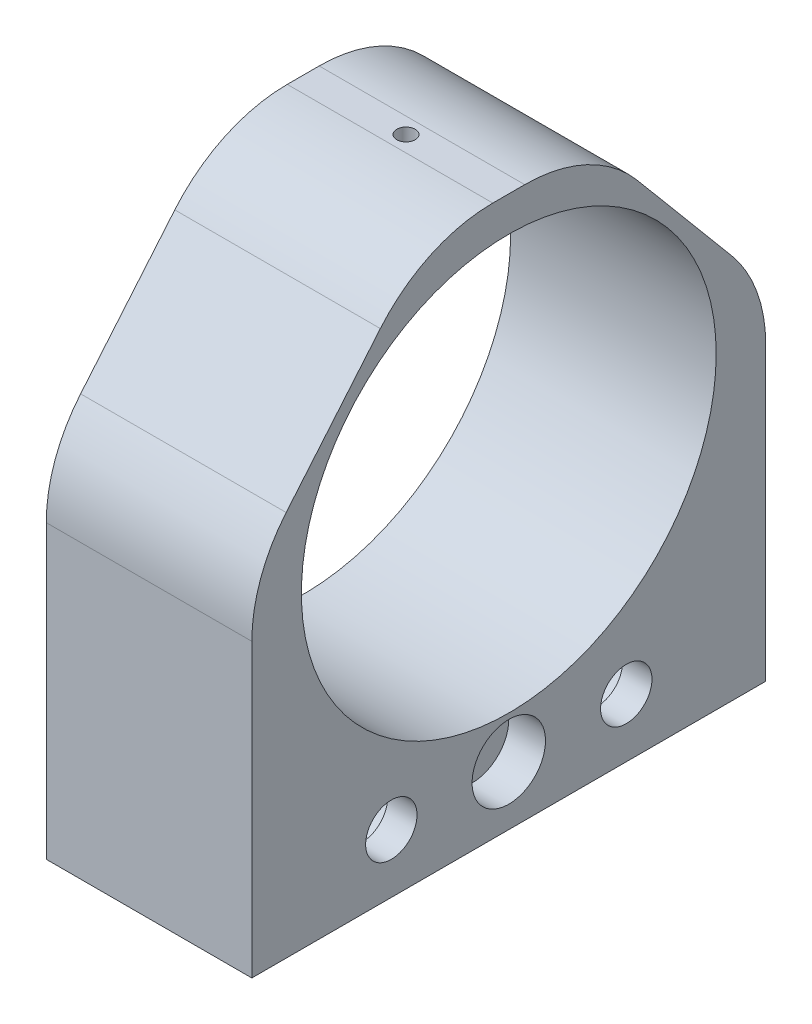
ISO-10303-21;
HEADER;
FILE_DESCRIPTION(('STEP AP214'),'2;1');
FILE_NAME('part.step','',(''),(''),'','','');
FILE_SCHEMA(('AUTOMOTIVE_DESIGN { 1 0 10303 214 1 1 1 1 }'));
ENDSEC;
DATA;
#1=APPLICATION_CONTEXT('core data for automotive mechanical design processes');
#2=APPLICATION_PROTOCOL_DEFINITION('international standard','automotive_design',2000,#1);
#3=PRODUCT_CONTEXT('',#1,'mechanical');
#4=PRODUCT('Part','Part','',(#3));
#5=PRODUCT_RELATED_PRODUCT_CATEGORY('part','',(#4));
#6=PRODUCT_DEFINITION_FORMATION('','',#4);
#7=PRODUCT_DEFINITION_CONTEXT('part definition',#1,'design');
#8=PRODUCT_DEFINITION('design','',#6,#7);
#9=PRODUCT_DEFINITION_SHAPE('','',#8);
#10=(LENGTH_UNIT() NAMED_UNIT(*) SI_UNIT(.MILLI.,.METRE.));
#11=(NAMED_UNIT(*) PLANE_ANGLE_UNIT() SI_UNIT($,.RADIAN.));
#12=(NAMED_UNIT(*) SI_UNIT($,.STERADIAN.) SOLID_ANGLE_UNIT());
#13=UNCERTAINTY_MEASURE_WITH_UNIT(LENGTH_MEASURE(1.E-05),#10,'distance_accuracy_value','');
#14=(GEOMETRIC_REPRESENTATION_CONTEXT(3) GLOBAL_UNCERTAINTY_ASSIGNED_CONTEXT((#13)) GLOBAL_UNIT_ASSIGNED_CONTEXT((#10,
#11,#12)) REPRESENTATION_CONTEXT('',''));
#15=CARTESIAN_POINT('',(0.,0.,0.));
#16=DIRECTION('',(0.,0.,1.));
#17=DIRECTION('',(1.,0.,0.));
#18=AXIS2_PLACEMENT_3D('',#15,#16,#17);
#19=CARTESIAN_POINT('',(0.,-29.5,-16.));
#20=DIRECTION('',(1.,0.,0.));
#21=DIRECTION('',(0.,0.,-1.));
#22=AXIS2_PLACEMENT_3D('',#19,#20,#21);
#23=CYLINDRICAL_SURFACE('',#22,3.5);
#24=CARTESIAN_POINT('',(28.,-29.5,-16.));
#25=DIRECTION('',(1.,0.,0.));
#26=DIRECTION('',(0.,0.,-1.));
#27=AXIS2_PLACEMENT_3D('',#24,#25,#26);
#28=CIRCLE('',#27,3.5);
#29=CARTESIAN_POINT('',(28.,-29.5,-19.5));
#30=VERTEX_POINT('',#29);
#31=EDGE_CURVE('E368',#30,#30,#28,.T.);
#32=ORIENTED_EDGE('',*,*,#31,.T.);
#33=EDGE_LOOP('',(#32));
#34=FACE_BOUND('',#33,.T.);
#35=CARTESIAN_POINT('',(24.,-29.5,-16.));
#36=DIRECTION('',(-1.,0.,0.));
#37=DIRECTION('',(0.,0.,1.));
#38=AXIS2_PLACEMENT_3D('',#35,#36,#37);
#39=CIRCLE('',#38,3.5);
#40=CARTESIAN_POINT('',(24.,-29.5,-12.5));
#41=VERTEX_POINT('',#40);
#42=EDGE_CURVE('E205',#41,#41,#39,.F.);
#43=ORIENTED_EDGE('',*,*,#42,.F.);
#44=EDGE_LOOP('',(#43));
#45=FACE_BOUND('',#44,.T.);
#46=ADVANCED_FACE('F32',(#34,#45),#23,.F.);
#47=CARTESIAN_POINT('',(0.,-29.5,16.));
#48=DIRECTION('',(1.,0.,0.));
#49=DIRECTION('',(0.,0.,-1.));
#50=AXIS2_PLACEMENT_3D('',#47,#48,#49);
#51=CYLINDRICAL_SURFACE('',#50,3.5);
#52=CARTESIAN_POINT('',(28.,-29.5,16.));
#53=DIRECTION('',(1.,0.,0.));
#54=DIRECTION('',(0.,0.,-1.));
#55=AXIS2_PLACEMENT_3D('',#52,#53,#54);
#56=CIRCLE('',#55,3.5);
#57=CARTESIAN_POINT('',(28.,-29.5,12.5));
#58=VERTEX_POINT('',#57);
#59=EDGE_CURVE('E369',#58,#58,#56,.T.);
#60=ORIENTED_EDGE('',*,*,#59,.T.);
#61=EDGE_LOOP('',(#60));
#62=FACE_BOUND('',#61,.T.);
#63=CARTESIAN_POINT('',(24.,-29.5,16.));
#64=DIRECTION('',(-1.,0.,0.));
#65=DIRECTION('',(0.,0.,1.));
#66=AXIS2_PLACEMENT_3D('',#63,#64,#65);
#67=CIRCLE('',#66,3.5);
#68=CARTESIAN_POINT('',(24.,-29.5,19.5));
#69=VERTEX_POINT('',#68);
#70=EDGE_CURVE('E187',#69,#69,#67,.F.);
#71=ORIENTED_EDGE('',*,*,#70,.F.);
#72=EDGE_LOOP('',(#71));
#73=FACE_BOUND('',#72,.T.);
#74=ADVANCED_FACE('F242',(#62,#73),#51,.F.);
#75=CARTESIAN_POINT('',(0.,-29.5,0.));
#76=DIRECTION('',(1.,0.,0.));
#77=DIRECTION('',(0.,0.,-1.));
#78=AXIS2_PLACEMENT_3D('',#75,#76,#77);
#79=CYLINDRICAL_SURFACE('',#78,2.6);
#80=CARTESIAN_POINT('',(0.,-29.5,0.));
#81=DIRECTION('',(1.,0.,0.));
#82=DIRECTION('',(0.,0.,-1.));
#83=AXIS2_PLACEMENT_3D('',#80,#81,#82);
#84=CIRCLE('',#83,2.6);
#85=CARTESIAN_POINT('',(0.,-29.5,-2.6));
#86=VERTEX_POINT('',#85);
#87=EDGE_CURVE('E358',#86,#86,#84,.T.);
#88=ORIENTED_EDGE('',*,*,#87,.F.);
#89=EDGE_LOOP('',(#88));
#90=FACE_BOUND('',#89,.T.);
#91=CARTESIAN_POINT('',(20.,-29.5,0.));
#92=DIRECTION('',(1.,0.,0.));
#93=DIRECTION('',(0.,0.,-1.));
#94=AXIS2_PLACEMENT_3D('',#91,#92,#93);
#95=CIRCLE('',#94,2.6);
#96=CARTESIAN_POINT('',(20.,-29.5,-2.6));
#97=VERTEX_POINT('',#96);
#98=EDGE_CURVE('E354',#97,#97,#95,.F.);
#99=ORIENTED_EDGE('',*,*,#98,.F.);
#100=EDGE_LOOP('',(#99));
#101=FACE_BOUND('',#100,.T.);
#102=ADVANCED_FACE('F248',(#90,#101),#79,.F.);
#103=CARTESIAN_POINT('',(28.,-37.5,35.));
#104=DIRECTION('',(0.,0.,-1.));
#105=DIRECTION('',(-1.,0.,0.));
#106=AXIS2_PLACEMENT_3D('',#103,#104,#105);
#107=PLANE('',#106);
#108=DIRECTION('',(0.,-1.,0.));
#109=VECTOR('',#108,1.);
#110=CARTESIAN_POINT('',(28.,-37.5,35.));
#111=LINE('',#110,#109);
#112=CARTESIAN_POINT('',(28.,2.21438588871199,35.));
#113=VERTEX_POINT('',#112);
#114=CARTESIAN_POINT('',(28.,-37.5,35.));
#115=VERTEX_POINT('',#114);
#116=EDGE_CURVE('E374',#113,#115,#111,.T.);
#117=ORIENTED_EDGE('',*,*,#116,.F.);
#118=DIRECTION('',(1.,0.,0.));
#119=VECTOR('',#118,1.);
#120=CARTESIAN_POINT('',(0.,2.21438588871199,35.));
#121=LINE('',#120,#119);
#122=CARTESIAN_POINT('',(0.,2.21438588871199,35.));
#123=VERTEX_POINT('',#122);
#124=EDGE_CURVE('E331',#113,#123,#121,.F.);
#125=ORIENTED_EDGE('',*,*,#124,.T.);
#126=DIRECTION('',(0.,-1.,0.));
#127=VECTOR('',#126,1.);
#128=CARTESIAN_POINT('',(0.,-37.5,35.));
#129=LINE('',#128,#127);
#130=CARTESIAN_POINT('',(0.,-37.5,35.));
#131=VERTEX_POINT('',#130);
#132=EDGE_CURVE('E372',#123,#131,#129,.T.);
#133=ORIENTED_EDGE('',*,*,#132,.T.);
#134=DIRECTION('',(-1.,0.,0.));
#135=VECTOR('',#134,1.);
#136=CARTESIAN_POINT('',(28.,-37.5,35.));
#137=LINE('',#136,#135);
#138=EDGE_CURVE('E395',#115,#131,#137,.T.);
#139=ORIENTED_EDGE('',*,*,#138,.F.);
#140=EDGE_LOOP('',(#117,#125,#133,#139));
#141=FACE_BOUND('',#140,.T.);
#142=ADVANCED_FACE('F275',(#141),#107,.F.);
#143=CARTESIAN_POINT('',(28.,-37.5,-35.));
#144=DIRECTION('',(0.,1.,0.));
#145=DIRECTION('',(0.,0.,1.));
#146=AXIS2_PLACEMENT_3D('',#143,#144,#145);
#147=PLANE('',#146);
#148=DIRECTION('',(-1.,0.,0.));
#149=VECTOR('',#148,1.);
#150=CARTESIAN_POINT('',(23.,-37.5,8.99999999999999));
#151=LINE('',#150,#149);
#152=CARTESIAN_POINT('',(23.,-37.5,8.99999999999999));
#153=VERTEX_POINT('',#152);
#154=CARTESIAN_POINT('',(20.,-37.5,8.99999999999999));
#155=VERTEX_POINT('',#154);
#156=EDGE_CURVE('E171',#153,#155,#151,.T.);
#157=ORIENTED_EDGE('',*,*,#156,.F.);
#158=DIRECTION('',(0.,0.,1.));
#159=VECTOR('',#158,1.);
#160=CARTESIAN_POINT('',(23.,-37.5,8.99999999999999));
#161=LINE('',#160,#159);
#162=CARTESIAN_POINT('',(23.,-37.5,-9.00000000000001));
#163=VERTEX_POINT('',#162);
#164=EDGE_CURVE('E47',#163,#153,#161,.T.);
#165=ORIENTED_EDGE('',*,*,#164,.F.);
#166=DIRECTION('',(1.,0.,0.));
#167=VECTOR('',#166,1.);
#168=CARTESIAN_POINT('',(23.,-37.5,-9.00000000000001));
#169=LINE('',#168,#167);
#170=CARTESIAN_POINT('',(20.,-37.5,-9.00000000000001));
#171=VERTEX_POINT('',#170);
#172=EDGE_CURVE('E152',#171,#163,#169,.T.);
#173=ORIENTED_EDGE('',*,*,#172,.F.);
#174=DIRECTION('',(0.,0.,-1.));
#175=VECTOR('',#174,1.);
#176=CARTESIAN_POINT('',(20.,-37.5,8.99999999999999));
#177=LINE('',#176,#175);
#178=EDGE_CURVE('E173',#155,#171,#177,.T.);
#179=ORIENTED_EDGE('',*,*,#178,.F.);
#180=EDGE_LOOP('',(#157,#165,#173,#179));
#181=FACE_BOUND('',#180,.T.);
#182=DIRECTION('',(0.,0.,-1.));
#183=VECTOR('',#182,1.);
#184=CARTESIAN_POINT('',(0.,-37.5,-35.));
#185=LINE('',#184,#183);
#186=CARTESIAN_POINT('',(0.,-37.5,-35.));
#187=VERTEX_POINT('',#186);
#188=EDGE_CURVE('E387',#131,#187,#185,.T.);
#189=ORIENTED_EDGE('',*,*,#188,.T.);
#190=DIRECTION('',(-1.,0.,0.));
#191=VECTOR('',#190,1.);
#192=CARTESIAN_POINT('',(28.,-37.5,-35.));
#193=LINE('',#192,#191);
#194=CARTESIAN_POINT('',(28.,-37.5,-35.));
#195=VERTEX_POINT('',#194);
#196=EDGE_CURVE('E385',#195,#187,#193,.T.);
#197=ORIENTED_EDGE('',*,*,#196,.F.);
#198=DIRECTION('',(0.,0.,-1.));
#199=VECTOR('',#198,1.);
#200=CARTESIAN_POINT('',(28.,-37.5,-35.));
#201=LINE('',#200,#199);
#202=EDGE_CURVE('E376',#115,#195,#201,.T.);
#203=ORIENTED_EDGE('',*,*,#202,.F.);
#204=ORIENTED_EDGE('',*,*,#138,.T.);
#205=EDGE_LOOP('',(#189,#197,#203,#204));
#206=FACE_BOUND('',#205,.T.);
#207=ADVANCED_FACE('F271',(#181,#206),#147,.F.);
#208=CARTESIAN_POINT('',(28.,-37.5,-35.));
#209=DIRECTION('',(0.,0.,1.));
#210=DIRECTION('',(1.,0.,0.));
#211=AXIS2_PLACEMENT_3D('',#208,#209,#210);
#212=PLANE('',#211);
#213=DIRECTION('',(0.,1.,0.));
#214=VECTOR('',#213,1.);
#215=CARTESIAN_POINT('',(0.,-37.5,-35.));
#216=LINE('',#215,#214);
#217=CARTESIAN_POINT('',(0.,2.21438588871199,-35.));
#218=VERTEX_POINT('',#217);
#219=EDGE_CURVE('E389',#187,#218,#216,.T.);
#220=ORIENTED_EDGE('',*,*,#219,.T.);
#221=DIRECTION('',(-1.,0.,0.));
#222=VECTOR('',#221,1.);
#223=CARTESIAN_POINT('',(28.,2.21438588871199,-35.));
#224=LINE('',#223,#222);
#225=CARTESIAN_POINT('',(28.,2.21438588871199,-35.));
#226=VERTEX_POINT('',#225);
#227=EDGE_CURVE('E409',#218,#226,#224,.F.);
#228=ORIENTED_EDGE('',*,*,#227,.T.);
#229=DIRECTION('',(0.,1.,0.));
#230=VECTOR('',#229,1.);
#231=CARTESIAN_POINT('',(28.,-37.5,-35.));
#232=LINE('',#231,#230);
#233=EDGE_CURVE('E379',#195,#226,#232,.T.);
#234=ORIENTED_EDGE('',*,*,#233,.F.);
#235=ORIENTED_EDGE('',*,*,#196,.T.);
#236=EDGE_LOOP('',(#220,#228,#234,#235));
#237=FACE_BOUND('',#236,.T.);
#238=ADVANCED_FACE('F267',(#237),#212,.F.);
#239=CARTESIAN_POINT('',(28.,37.5,-35.));
#240=DIRECTION('',(0.,-1.,0.));
#241=DIRECTION('',(0.,0.,-1.));
#242=AXIS2_PLACEMENT_3D('',#239,#240,#241);
#243=PLANE('',#242);
#244=CARTESIAN_POINT('',(14.,37.5,0.));
#245=DIRECTION('',(0.,1.,0.));
#246=DIRECTION('',(0.,0.,1.));
#247=AXIS2_PLACEMENT_3D('',#244,#245,#246);
#248=CIRCLE('',#247,1.25);
#249=CARTESIAN_POINT('',(14.,37.5,1.25000000000001));
#250=VERTEX_POINT('',#249);
#251=EDGE_CURVE('E204',#250,#250,#248,.T.);
#252=ORIENTED_EDGE('',*,*,#251,.F.);
#253=EDGE_LOOP('',(#252));
#254=FACE_BOUND('',#253,.T.);
#255=DIRECTION('',(0.,0.,1.));
#256=VECTOR('',#255,1.);
#257=CARTESIAN_POINT('',(28.,37.5,-35.));
#258=LINE('',#257,#256);
#259=CARTESIAN_POINT('',(28.,37.5,-2.17384683689997));
#260=VERTEX_POINT('',#259);
#261=CARTESIAN_POINT('',(28.,37.5,2.17384683689999));
#262=VERTEX_POINT('',#261);
#263=EDGE_CURVE('E382',#260,#262,#258,.T.);
#264=ORIENTED_EDGE('',*,*,#263,.F.);
#265=DIRECTION('',(1.,0.,0.));
#266=VECTOR('',#265,1.);
#267=CARTESIAN_POINT('',(0.,37.5,-2.17384683689998));
#268=LINE('',#267,#266);
#269=CARTESIAN_POINT('',(0.,37.5,-2.17384683689997));
#270=VERTEX_POINT('',#269);
#271=EDGE_CURVE('E325',#260,#270,#268,.F.);
#272=ORIENTED_EDGE('',*,*,#271,.T.);
#273=DIRECTION('',(0.,0.,1.));
#274=VECTOR('',#273,1.);
#275=CARTESIAN_POINT('',(0.,37.5,-35.));
#276=LINE('',#275,#274);
#277=CARTESIAN_POINT('',(0.,37.5,2.17384683689999));
#278=VERTEX_POINT('',#277);
#279=EDGE_CURVE('E377',#270,#278,#276,.T.);
#280=ORIENTED_EDGE('',*,*,#279,.T.);
#281=DIRECTION('',(-1.,0.,0.));
#282=VECTOR('',#281,1.);
#283=CARTESIAN_POINT('',(28.,37.5,2.17384683689998));
#284=LINE('',#283,#282);
#285=EDGE_CURVE('E309',#278,#262,#284,.F.);
#286=ORIENTED_EDGE('',*,*,#285,.T.);
#287=EDGE_LOOP('',(#264,#272,#280,#286));
#288=FACE_BOUND('',#287,.T.);
#289=ADVANCED_FACE('F259',(#254,#288),#243,.F.);
#290=CARTESIAN_POINT('',(28.,0.,0.));
#291=DIRECTION('',(1.,0.,0.));
#292=DIRECTION('',(0.,0.,-1.));
#293=AXIS2_PLACEMENT_3D('',#290,#291,#292);
#294=PLANE('',#293);
#295=CARTESIAN_POINT('',(28.,4.49999999999999,0.));
#296=DIRECTION('',(1.,0.,0.));
#297=DIRECTION('',(0.,0.,-1.));
#298=AXIS2_PLACEMENT_3D('',#295,#296,#297);
#299=CIRCLE('',#298,28.25);
#300=CARTESIAN_POINT('',(28.,4.49999999999999,-28.25));
#301=VERTEX_POINT('',#300);
#302=EDGE_CURVE('E364',#301,#301,#299,.T.);
#303=ORIENTED_EDGE('',*,*,#302,.F.);
#304=EDGE_LOOP('',(#303));
#305=FACE_BOUND('',#304,.T.);
#306=CARTESIAN_POINT('',(28.,-29.5,0.));
#307=DIRECTION('',(1.,0.,0.));
#308=DIRECTION('',(0.,0.,-1.));
#309=AXIS2_PLACEMENT_3D('',#306,#307,#308);
#310=CIRCLE('',#309,5.);
#311=CARTESIAN_POINT('',(28.,-29.5,-5.));
#312=VERTEX_POINT('',#311);
#313=EDGE_CURVE('E355',#312,#312,#310,.T.);
#314=ORIENTED_EDGE('',*,*,#313,.F.);
#315=EDGE_LOOP('',(#314));
#316=FACE_BOUND('',#315,.T.);
#317=ORIENTED_EDGE('',*,*,#59,.F.);
#318=EDGE_LOOP('',(#317));
#319=FACE_BOUND('',#318,.T.);
#320=ORIENTED_EDGE('',*,*,#31,.F.);
#321=EDGE_LOOP('',(#320));
#322=FACE_BOUND('',#321,.T.);
#323=ORIENTED_EDGE('',*,*,#233,.T.);
#324=CARTESIAN_POINT('',(28.,2.21438588871199,-15.));
#325=DIRECTION('',(1.,0.,0.));
#326=DIRECTION('',(0.,0.,-1.));
#327=AXIS2_PLACEMENT_3D('',#324,#325,#326);
#328=CIRCLE('',#327,20.);
#329=CARTESIAN_POINT('',(28.,15.0701380824428,-30.3208888623796));
#330=VERTEX_POINT('',#329);
#331=EDGE_CURVE('E418',#226,#330,#328,.T.);
#332=ORIENTED_EDGE('',*,*,#331,.T.);
#333=DIRECTION('',(0.,-0.766044443118977,-0.642787609686541));
#334=VECTOR('',#333,1.);
#335=CARTESIAN_POINT('',(28.,21.1567412485653,-25.2136223905637));
#336=LINE('',#335,#334);
#337=CARTESIAN_POINT('',(28.,30.3557521937308,-17.4947356992795));
#338=VERTEX_POINT('',#337);
#339=EDGE_CURVE('E406',#330,#338,#336,.F.);
#340=ORIENTED_EDGE('',*,*,#339,.T.);
#341=CARTESIAN_POINT('',(28.,17.5,-2.17384683689998));
#342=DIRECTION('',(1.,0.,0.));
#343=DIRECTION('',(0.,0.,-1.));
#344=AXIS2_PLACEMENT_3D('',#341,#342,#343);
#345=CIRCLE('',#344,20.);
#346=EDGE_CURVE('E416',#338,#260,#345,.T.);
#347=ORIENTED_EDGE('',*,*,#346,.T.);
#348=ORIENTED_EDGE('',*,*,#263,.T.);
#349=CARTESIAN_POINT('',(28.,17.5,2.17384683689998));
#350=DIRECTION('',(1.,0.,0.));
#351=DIRECTION('',(0.,0.,-1.));
#352=AXIS2_PLACEMENT_3D('',#349,#350,#351);
#353=CIRCLE('',#352,20.);
#354=CARTESIAN_POINT('',(28.,30.3557521937308,17.4947356992795));
#355=VERTEX_POINT('',#354);
#356=EDGE_CURVE('E414',#262,#355,#353,.T.);
#357=ORIENTED_EDGE('',*,*,#356,.T.);
#358=DIRECTION('',(0.,0.766044443118977,-0.64278760968654));
#359=VECTOR('',#358,1.);
#360=CARTESIAN_POINT('',(28.,21.1567412485653,25.2136223905637));
#361=LINE('',#360,#359);
#362=CARTESIAN_POINT('',(28.,15.0701380824428,30.3208888623795));
#363=VERTEX_POINT('',#362);
#364=EDGE_CURVE('E403',#355,#363,#361,.F.);
#365=ORIENTED_EDGE('',*,*,#364,.T.);
#366=CARTESIAN_POINT('',(28.,2.21438588871199,15.));
#367=DIRECTION('',(1.,0.,0.));
#368=DIRECTION('',(0.,0.,-1.));
#369=AXIS2_PLACEMENT_3D('',#366,#367,#368);
#370=CIRCLE('',#369,20.);
#371=EDGE_CURVE('E412',#363,#113,#370,.T.);
#372=ORIENTED_EDGE('',*,*,#371,.T.);
#373=ORIENTED_EDGE('',*,*,#116,.T.);
#374=ORIENTED_EDGE('',*,*,#202,.T.);
#375=EDGE_LOOP('',(#323,#332,#340,#347,#348,#357,#365,#372,#373,#374));
#376=FACE_BOUND('',#375,.T.);
#377=ADVANCED_FACE('F255',(#305,#316,#319,#322,#376),#294,.T.);
#378=CARTESIAN_POINT('',(0.,0.,0.));
#379=DIRECTION('',(1.,0.,0.));
#380=DIRECTION('',(0.,0.,-1.));
#381=AXIS2_PLACEMENT_3D('',#378,#379,#380);
#382=PLANE('',#381);
#383=CARTESIAN_POINT('',(0.,-29.5,-16.));
#384=DIRECTION('',(-1.,0.,0.));
#385=DIRECTION('',(0.,0.,1.));
#386=AXIS2_PLACEMENT_3D('',#383,#384,#385);
#387=CIRCLE('',#386,6.4);
#388=CARTESIAN_POINT('',(0.,-29.5,-9.60000000000002));
#389=VERTEX_POINT('',#388);
#390=EDGE_CURVE('E188',#389,#389,#387,.T.);
#391=ORIENTED_EDGE('',*,*,#390,.F.);
#392=EDGE_LOOP('',(#391));
#393=FACE_BOUND('',#392,.T.);
#394=CARTESIAN_POINT('',(0.,-29.5,16.));
#395=DIRECTION('',(-1.,0.,0.));
#396=DIRECTION('',(0.,0.,1.));
#397=AXIS2_PLACEMENT_3D('',#394,#395,#396);
#398=CIRCLE('',#397,6.4);
#399=CARTESIAN_POINT('',(0.,-29.5,22.4));
#400=VERTEX_POINT('',#399);
#401=EDGE_CURVE('E180',#400,#400,#398,.T.);
#402=ORIENTED_EDGE('',*,*,#401,.F.);
#403=EDGE_LOOP('',(#402));
#404=FACE_BOUND('',#403,.T.);
#405=CARTESIAN_POINT('',(0.,4.49999999999999,0.));
#406=DIRECTION('',(1.,0.,0.));
#407=DIRECTION('',(0.,0.,-1.));
#408=AXIS2_PLACEMENT_3D('',#405,#406,#407);
#409=CIRCLE('',#408,28.25);
#410=CARTESIAN_POINT('',(0.,4.49999999999999,-28.25));
#411=VERTEX_POINT('',#410);
#412=EDGE_CURVE('E361',#411,#411,#409,.T.);
#413=ORIENTED_EDGE('',*,*,#412,.T.);
#414=EDGE_LOOP('',(#413));
#415=FACE_BOUND('',#414,.T.);
#416=ORIENTED_EDGE('',*,*,#87,.T.);
#417=EDGE_LOOP('',(#416));
#418=FACE_BOUND('',#417,.T.);
#419=DIRECTION('',(0.,0.766044443118977,0.642787609686541));
#420=VECTOR('',#419,1.);
#421=CARTESIAN_POINT('',(0.,37.5,-11.4999999999999));
#422=LINE('',#421,#420);
#423=CARTESIAN_POINT('',(0.,30.3557521937308,-17.4947356992795));
#424=VERTEX_POINT('',#423);
#425=CARTESIAN_POINT('',(0.,15.0701380824428,-30.3208888623796));
#426=VERTEX_POINT('',#425);
#427=EDGE_CURVE('E400',#424,#426,#422,.F.);
#428=ORIENTED_EDGE('',*,*,#427,.T.);
#429=CARTESIAN_POINT('',(0.,2.21438588871199,-15.));
#430=DIRECTION('',(1.,0.,0.));
#431=DIRECTION('',(0.,0.,-1.));
#432=AXIS2_PLACEMENT_3D('',#429,#430,#431);
#433=CIRCLE('',#432,20.);
#434=EDGE_CURVE('E317',#426,#218,#433,.F.);
#435=ORIENTED_EDGE('',*,*,#434,.T.);
#436=ORIENTED_EDGE('',*,*,#219,.F.);
#437=ORIENTED_EDGE('',*,*,#188,.F.);
#438=ORIENTED_EDGE('',*,*,#132,.F.);
#439=CARTESIAN_POINT('',(0.,2.21438588871199,15.));
#440=DIRECTION('',(1.,0.,0.));
#441=DIRECTION('',(0.,0.,-1.));
#442=AXIS2_PLACEMENT_3D('',#439,#440,#441);
#443=CIRCLE('',#442,20.);
#444=CARTESIAN_POINT('',(0.,15.0701380824428,30.3208888623795));
#445=VERTEX_POINT('',#444);
#446=EDGE_CURVE('E315',#123,#445,#443,.F.);
#447=ORIENTED_EDGE('',*,*,#446,.T.);
#448=DIRECTION('',(0.,-0.766044443118977,0.64278760968654));
#449=VECTOR('',#448,1.);
#450=CARTESIAN_POINT('',(0.,9.49379057403606,35.));
#451=LINE('',#450,#449);
#452=CARTESIAN_POINT('',(0.,30.3557521937308,17.4947356992795));
#453=VERTEX_POINT('',#452);
#454=EDGE_CURVE('E397',#445,#453,#451,.F.);
#455=ORIENTED_EDGE('',*,*,#454,.T.);
#456=CARTESIAN_POINT('',(0.,17.5,2.17384683689998));
#457=DIRECTION('',(1.,0.,0.));
#458=DIRECTION('',(0.,0.,-1.));
#459=AXIS2_PLACEMENT_3D('',#456,#457,#458);
#460=CIRCLE('',#459,20.);
#461=EDGE_CURVE('E306',#453,#278,#460,.F.);
#462=ORIENTED_EDGE('',*,*,#461,.T.);
#463=ORIENTED_EDGE('',*,*,#279,.F.);
#464=CARTESIAN_POINT('',(0.,17.5,-2.17384683689998));
#465=DIRECTION('',(1.,0.,0.));
#466=DIRECTION('',(0.,0.,-1.));
#467=AXIS2_PLACEMENT_3D('',#464,#465,#466);
#468=CIRCLE('',#467,20.);
#469=EDGE_CURVE('E314',#270,#424,#468,.F.);
#470=ORIENTED_EDGE('',*,*,#469,.T.);
#471=EDGE_LOOP('',(#428,#435,#436,#437,#438,#447,#455,#462,#463,#470));
#472=FACE_BOUND('',#471,.T.);
#473=ADVANCED_FACE('F258',(#393,#404,#415,#418,#472),#382,.F.);
#474=CARTESIAN_POINT('',(20.,-29.5,0.));
#475=DIRECTION('',(1.,0.,0.));
#476=DIRECTION('',(0.,0.,-1.));
#477=AXIS2_PLACEMENT_3D('',#474,#475,#476);
#478=PLANE('',#477);
#479=CARTESIAN_POINT('',(20.,-29.5,0.));
#480=DIRECTION('',(1.,0.,0.));
#481=DIRECTION('',(0.,0.,-1.));
#482=AXIS2_PLACEMENT_3D('',#479,#480,#481);
#483=CIRCLE('',#482,5.);
#484=CARTESIAN_POINT('',(20.,-25.5,-2.99999999999999));
#485=VERTEX_POINT('',#484);
#486=CARTESIAN_POINT('',(20.,-25.5,2.99999999999999));
#487=VERTEX_POINT('',#486);
#488=EDGE_CURVE('E353',#485,#487,#483,.T.);
#489=ORIENTED_EDGE('',*,*,#488,.T.);
#490=DIRECTION('',(0.,0.,-1.));
#491=VECTOR('',#490,1.);
#492=CARTESIAN_POINT('',(20.,-25.5,8.99999999999999));
#493=LINE('',#492,#491);
#494=CARTESIAN_POINT('',(20.,-25.5,8.99999999999999));
#495=VERTEX_POINT('',#494);
#496=EDGE_CURVE('E166',#495,#487,#493,.T.);
#497=ORIENTED_EDGE('',*,*,#496,.F.);
#498=DIRECTION('',(0.,-1.,0.));
#499=VECTOR('',#498,1.);
#500=CARTESIAN_POINT('',(20.,-25.5,8.99999999999999));
#501=LINE('',#500,#499);
#502=EDGE_CURVE('E159',#495,#155,#501,.T.);
#503=ORIENTED_EDGE('',*,*,#502,.T.);
#504=ORIENTED_EDGE('',*,*,#178,.T.);
#505=DIRECTION('',(0.,-1.,0.));
#506=VECTOR('',#505,1.);
#507=CARTESIAN_POINT('',(20.,-25.5,-9.00000000000001));
#508=LINE('',#507,#506);
#509=CARTESIAN_POINT('',(20.,-25.5,-9.00000000000001));
#510=VERTEX_POINT('',#509);
#511=EDGE_CURVE('E181',#510,#171,#508,.T.);
#512=ORIENTED_EDGE('',*,*,#511,.F.);
#513=EDGE_CURVE('E164',#485,#510,#493,.T.);
#514=ORIENTED_EDGE('',*,*,#513,.F.);
#515=EDGE_LOOP('',(#489,#497,#503,#504,#512,#514));
#516=FACE_BOUND('',#515,.T.);
#517=ORIENTED_EDGE('',*,*,#98,.T.);
#518=EDGE_LOOP('',(#517));
#519=FACE_BOUND('',#518,.T.);
#520=ADVANCED_FACE('F263',(#516,#519),#478,.T.);
#521=CARTESIAN_POINT('',(20.,-29.5,0.));
#522=DIRECTION('',(1.,0.,0.));
#523=DIRECTION('',(0.,0.,-1.));
#524=AXIS2_PLACEMENT_3D('',#521,#522,#523);
#525=CYLINDRICAL_SURFACE('',#524,5.);
#526=CARTESIAN_POINT('',(23.,-29.5,0.));
#527=DIRECTION('',(1.,0.,0.));
#528=DIRECTION('',(0.,0.,-1.));
#529=AXIS2_PLACEMENT_3D('',#526,#527,#528);
#530=CIRCLE('',#529,5.);
#531=CARTESIAN_POINT('',(23.,-25.5,-2.99999999999999));
#532=VERTEX_POINT('',#531);
#533=CARTESIAN_POINT('',(23.,-25.5,2.99999999999999));
#534=VERTEX_POINT('',#533);
#535=EDGE_CURVE('E40',#532,#534,#530,.F.);
#536=ORIENTED_EDGE('',*,*,#535,.T.);
#537=DIRECTION('',(1.,0.,0.));
#538=VECTOR('',#537,1.);
#539=CARTESIAN_POINT('',(20.,-25.5,2.99999999999999));
#540=LINE('',#539,#538);
#541=EDGE_CURVE('E11',#534,#487,#540,.F.);
#542=ORIENTED_EDGE('',*,*,#541,.T.);
#543=ORIENTED_EDGE('',*,*,#488,.F.);
#544=DIRECTION('',(1.,0.,0.));
#545=VECTOR('',#544,1.);
#546=CARTESIAN_POINT('',(20.,-25.5,-2.99999999999999));
#547=LINE('',#546,#545);
#548=EDGE_CURVE('E334',#485,#532,#547,.T.);
#549=ORIENTED_EDGE('',*,*,#548,.T.);
#550=EDGE_LOOP('',(#536,#542,#543,#549));
#551=FACE_BOUND('',#550,.T.);
#552=ORIENTED_EDGE('',*,*,#313,.T.);
#553=EDGE_LOOP('',(#552));
#554=FACE_BOUND('',#553,.T.);
#555=ADVANCED_FACE('F341',(#551,#554),#525,.F.);
#556=CARTESIAN_POINT('',(0.,4.49999999999999,0.));
#557=DIRECTION('',(1.,0.,0.));
#558=DIRECTION('',(0.,0.,-1.));
#559=AXIS2_PLACEMENT_3D('',#556,#557,#558);
#560=CYLINDRICAL_SURFACE('',#559,28.25);
#561=CARTESIAN_POINT('',(14.,32.7223315833402,1.25000000000001));
#562=CARTESIAN_POINT('',(13.9298238347446,32.7223319555851,1.24999689947452));
#563=CARTESIAN_POINT('',(13.8595976599736,32.7225961406315,1.24407052256747));
#564=CARTESIAN_POINT('',(13.7210819063996,32.7236245445564,1.22051268628384));
#565=CARTESIAN_POINT('',(13.6527947199612,32.7243893553391,1.20286737090482));
#566=CARTESIAN_POINT('',(13.5201835719204,32.7263322069692,1.15637723229616));
#567=CARTESIAN_POINT('',(13.4558576364,32.7275100400134,1.12753804023909));
#568=CARTESIAN_POINT('',(13.3329774664039,32.7301459546491,1.05948724349167));
#569=CARTESIAN_POINT('',(13.2744218583586,32.7316039693011,1.02027811548848));
#570=CARTESIAN_POINT('',(13.1646786485902,32.7346373366156,0.932564114372352));
#571=CARTESIAN_POINT('',(13.1134963553467,32.7362127725904,0.884052601926537));
#572=CARTESIAN_POINT('',(13.019997793979,32.7393026663578,0.779123849750826));
#573=CARTESIAN_POINT('',(12.9776818847428,32.74081712168,0.722706290159231));
#574=CARTESIAN_POINT('',(12.9031039023367,32.743614971383,0.603540715665921));
#575=CARTESIAN_POINT('',(12.8708457773028,32.7448982749429,0.540790227564895));
#576=CARTESIAN_POINT('',(12.8173244473811,32.7470883860965,0.410757506373249));
#577=CARTESIAN_POINT('',(12.7960611725561,32.7479951960849,0.343475302111517));
#578=CARTESIAN_POINT('',(12.7651466394996,32.7493295842906,0.206336180296461));
#579=CARTESIAN_POINT('',(12.7554877134334,32.7497574789491,0.136480994389434));
#580=CARTESIAN_POINT('',(12.7480324044498,32.7500868730652,-0.00386048999238424));
#581=CARTESIAN_POINT('',(12.7502359437645,32.7499883759736,-0.0743467843267268));
#582=CARTESIAN_POINT('',(12.7664366293439,32.7492763547035,-0.213897718139754));
#583=CARTESIAN_POINT('',(12.7804255180383,32.7486631911345,-0.282963318346846));
#584=CARTESIAN_POINT('',(12.8197870153033,32.746991331012,-0.417764956285699));
#585=CARTESIAN_POINT('',(12.8451596639587,32.7459326328898,-0.483500982292388));
#586=CARTESIAN_POINT('',(12.9065778822759,32.7434883595775,-0.609804071030293));
#587=CARTESIAN_POINT('',(12.9426272218869,32.7421026689613,-0.670369298199919));
#588=CARTESIAN_POINT('',(13.0243727509795,32.7391604995696,-0.784591488101701));
#589=CARTESIAN_POINT('',(13.0700689929819,32.7376040198644,-0.83824841322044));
#590=CARTESIAN_POINT('',(13.1698578784711,32.7344940235612,-0.93717902425128));
#591=CARTESIAN_POINT('',(13.2239576855607,32.7329405106468,-0.982445484843373));
#592=CARTESIAN_POINT('',(13.3389928099348,32.7300129303781,-1.06325457176403));
#593=CARTESIAN_POINT('',(13.3999281287614,32.7286388630642,-1.09879719589885));
#594=CARTESIAN_POINT('',(13.5269088115735,32.7262252227951,-1.15914900526961));
#595=CARTESIAN_POINT('',(13.5929542988517,32.7251856579135,-1.18395793143925));
#596=CARTESIAN_POINT('',(13.7282786064608,32.7235585688272,-1.22213334512743));
#597=CARTESIAN_POINT('',(13.7975574077365,32.7229710419587,-1.23549990007178));
#598=CARTESIAN_POINT('',(13.9373188600122,32.7223147717195,-1.25040223197549));
#599=CARTESIAN_POINT('',(14.0078004403832,32.7222455888639,-1.25194803133954));
#600=CARTESIAN_POINT('',(14.1480220262523,32.7226326610617,-1.24319111485885));
#601=CARTESIAN_POINT('',(14.2177620336618,32.7230889147605,-1.23288842955929));
#602=CARTESIAN_POINT('',(14.3544927243188,32.7244750318749,-1.20073530732056));
#603=CARTESIAN_POINT('',(14.4214844857908,32.7254047075941,-1.17888944674434));
#604=CARTESIAN_POINT('',(14.5508502167175,32.7276327198111,-1.12427473027358));
#605=CARTESIAN_POINT('',(14.6132241653317,32.7289310579726,-1.09150582508655));
#606=CARTESIAN_POINT('',(14.7316298346057,32.7317511223928,-1.01594944634705));
#607=CARTESIAN_POINT('',(14.7876572516488,32.7332729986467,-0.973155234203248));
#608=CARTESIAN_POINT('',(14.8917361764857,32.7363680688365,-0.878772872808183));
#609=CARTESIAN_POINT('',(14.9397876436898,32.7379412630334,-0.827184678807102));
#610=CARTESIAN_POINT('',(15.0265842700899,32.7409629268885,-0.716635744364322));
#611=CARTESIAN_POINT('',(15.0653229596112,32.7424113093933,-0.657669921605677));
#612=CARTESIAN_POINT('',(15.1323501612313,32.7450188600505,-0.534065306507825));
#613=CARTESIAN_POINT('',(15.1606387114199,32.7461780292571,-0.469426534847029));
#614=CARTESIAN_POINT('',(15.2059512950727,32.7480760879666,-0.336335056356896));
#615=CARTESIAN_POINT('',(15.222979484808,32.7488151325262,-0.267883766878571));
#616=CARTESIAN_POINT('',(15.2453015955026,32.7497902616925,-0.129090424450387));
#617=CARTESIAN_POINT('',(15.2505955637055,32.7500263483243,-0.0587483791141454));
#618=CARTESIAN_POINT('',(15.2492984780348,32.7499689633538,0.081765407942786));
#619=CARTESIAN_POINT('',(15.2427175835894,32.7496759444228,0.15193724385803));
#620=CARTESIAN_POINT('',(15.2178785529569,32.748594235711,0.290178863984283));
#621=CARTESIAN_POINT('',(15.199620394329,32.7478055449776,0.358248644155411));
#622=CARTESIAN_POINT('',(15.1519470681153,32.7458212595612,0.490356369720253));
#623=CARTESIAN_POINT('',(15.1225317737497,32.7446256602544,0.554394269289606));
#624=CARTESIAN_POINT('',(15.0533812054842,32.7419621044131,0.676622670808741));
#625=CARTESIAN_POINT('',(15.0136462674323,32.7404941567425,0.734813362967687));
#626=CARTESIAN_POINT('',(14.9249489586458,32.7374497812031,0.843745648455992));
#627=CARTESIAN_POINT('',(14.8759797145612,32.7358732730882,0.89448164267569));
#628=CARTESIAN_POINT('',(14.7702044431971,32.7327899153122,0.987027782933803));
#629=CARTESIAN_POINT('',(14.7133964866386,32.7312830829221,1.02883572510962));
#630=CARTESIAN_POINT('',(14.5935193391708,32.7285081757889,1.10235432543554));
#631=CARTESIAN_POINT('',(14.5304448471051,32.7272403058673,1.1340563374486));
#632=CARTESIAN_POINT('',(14.3999106485391,32.725089684609,1.18638298978263));
#633=CARTESIAN_POINT('',(14.3324562454866,32.724206477137,1.2070207569072));
#634=CARTESIAN_POINT('',(14.2204836148353,32.7231593893655,1.23120077231244));
#635=CARTESIAN_POINT('',(14.176691192017,32.7228503242268,1.23824152646423));
#636=CARTESIAN_POINT('',(14.088605826038,32.7224363037541,1.24764211767747));
#637=CARTESIAN_POINT('',(14.0443128832083,32.7223313482853,1.25000195783317));
#638=CARTESIAN_POINT('',(14.,32.7223315833402,1.25000000000001));
#639=B_SPLINE_CURVE_WITH_KNOTS('',3,(#561,#562,#563,#564,#565,#566,#567,#568,#569,#570,#571,
#572,#573,#574,#575,#576,#577,#578,#579,#580,#581,#582,#583,#584,#585,#586,#587,#588,#589,#590,
#591,#592,#593,#594,#595,#596,#597,#598,#599,#600,#601,#602,#603,#604,#605,#606,#607,#608,#609,
#610,#611,#612,#613,#614,#615,#616,#617,#618,#619,#620,#621,#622,#623,#624,#625,#626,#627,#628,
#629,#630,#631,#632,#633,#634,#635,#636,#637,#638),.UNSPECIFIED.,.T.,.F.,(4,2,2,2,2,2,2,2,2,2,2,
2,2,2,2,2,2,2,2,2,2,2,2,2,2,2,2,2,2,2,2,2,2,2,2,2,2,2,4),(0.,0.210366740560029,
0.420982654176176,0.631492752741702,0.84195261979364,1.05256325993779,1.26318242339776,
1.47388416063236,1.68458455759698,1.89514565282179,2.10570536765084,2.31611767344397,
2.52653072015107,2.73701815265301,2.94750673114084,3.15817573499141,3.36884478636995,
3.57951892212949,3.79019181645311,4.00068606878153,4.21117977846102,4.42159009915814,
4.6320013693883,4.84255447711616,5.05310865631484,5.2638086895011,5.47450795469858,
5.68512940597534,5.89575000925747,6.10619050346987,6.31663140209683,6.52707469205936,
6.73751113410168,6.94810483253517,7.15875045544823,7.3695758157118,7.58015049261754,
7.71298708939625,7.84582359836502),.UNSPECIFIED.);
#640=CARTESIAN_POINT('',(14.,32.7223315833402,1.25000000000001));
#641=VERTEX_POINT('',#640);
#642=EDGE_CURVE('E196',#641,#641,#639,.T.);
#643=ORIENTED_EDGE('',*,*,#642,.F.);
#644=EDGE_LOOP('',(#643));
#645=FACE_BOUND('',#644,.T.);
#646=ORIENTED_EDGE('',*,*,#412,.F.);
#647=EDGE_LOOP('',(#646));
#648=FACE_BOUND('',#647,.T.);
#649=ORIENTED_EDGE('',*,*,#302,.T.);
#650=EDGE_LOOP('',(#649));
#651=FACE_BOUND('',#650,.T.);
#652=ADVANCED_FACE('F284',(#645,#648,#651),#560,.F.);
#653=CARTESIAN_POINT('',(28.,37.5,-11.4999999999999));
#654=DIRECTION('',(0.,-0.642787609686541,0.766044443118977));
#655=DIRECTION('',(-1.,0.,0.));
#656=AXIS2_PLACEMENT_3D('',#653,#654,#655);
#657=PLANE('',#656);
#658=ORIENTED_EDGE('',*,*,#339,.F.);
#659=DIRECTION('',(1.,0.,0.));
#660=VECTOR('',#659,1.);
#661=CARTESIAN_POINT('',(0.,15.0701380824428,-30.3208888623796));
#662=LINE('',#661,#660);
#663=EDGE_CURVE('E319',#330,#426,#662,.F.);
#664=ORIENTED_EDGE('',*,*,#663,.T.);
#665=ORIENTED_EDGE('',*,*,#427,.F.);
#666=DIRECTION('',(-1.,0.,0.));
#667=VECTOR('',#666,1.);
#668=CARTESIAN_POINT('',(28.,30.3557521937308,-17.4947356992795));
#669=LINE('',#668,#667);
#670=EDGE_CURVE('E420',#424,#338,#669,.F.);
#671=ORIENTED_EDGE('',*,*,#670,.T.);
#672=EDGE_LOOP('',(#658,#664,#665,#671));
#673=FACE_BOUND('',#672,.T.);
#674=ADVANCED_FACE('F280',(#673),#657,.F.);
#675=CARTESIAN_POINT('',(28.,9.49379057403606,35.));
#676=DIRECTION('',(0.,-0.64278760968654,-0.766044443118977));
#677=DIRECTION('',(-1.,0.,0.));
#678=AXIS2_PLACEMENT_3D('',#675,#676,#677);
#679=PLANE('',#678);
#680=ORIENTED_EDGE('',*,*,#364,.F.);
#681=DIRECTION('',(1.,0.,0.));
#682=VECTOR('',#681,1.);
#683=CARTESIAN_POINT('',(0.,30.3557521937308,17.4947356992795));
#684=LINE('',#683,#682);
#685=EDGE_CURVE('E307',#355,#453,#684,.F.);
#686=ORIENTED_EDGE('',*,*,#685,.T.);
#687=ORIENTED_EDGE('',*,*,#454,.F.);
#688=DIRECTION('',(-1.,0.,0.));
#689=VECTOR('',#688,1.);
#690=CARTESIAN_POINT('',(28.,15.0701380824428,30.3208888623795));
#691=LINE('',#690,#689);
#692=EDGE_CURVE('E328',#445,#363,#691,.F.);
#693=ORIENTED_EDGE('',*,*,#692,.T.);
#694=EDGE_LOOP('',(#680,#686,#687,#693));
#695=FACE_BOUND('',#694,.T.);
#696=ADVANCED_FACE('F283',(#695),#679,.F.);
#697=CARTESIAN_POINT('',(14.,-37.501,0.));
#698=DIRECTION('',(0.,1.,0.));
#699=DIRECTION('',(0.,0.,1.));
#700=AXIS2_PLACEMENT_3D('',#697,#698,#699);
#701=CYLINDRICAL_SURFACE('',#700,1.25);
#702=ORIENTED_EDGE('',*,*,#251,.T.);
#703=EDGE_LOOP('',(#702));
#704=FACE_BOUND('',#703,.T.);
#705=ORIENTED_EDGE('',*,*,#642,.T.);
#706=EDGE_LOOP('',(#705));
#707=FACE_BOUND('',#706,.T.);
#708=ADVANCED_FACE('F207',(#704,#707),#701,.F.);
#709=CARTESIAN_POINT('',(28.,2.21438588871199,-15.));
#710=DIRECTION('',(1.,0.,0.));
#711=DIRECTION('',(0.,0.,-1.));
#712=AXIS2_PLACEMENT_3D('',#709,#710,#711);
#713=CYLINDRICAL_SURFACE('',#712,20.);
#714=ORIENTED_EDGE('',*,*,#434,.F.);
#715=ORIENTED_EDGE('',*,*,#663,.F.);
#716=ORIENTED_EDGE('',*,*,#331,.F.);
#717=ORIENTED_EDGE('',*,*,#227,.F.);
#718=EDGE_LOOP('',(#714,#715,#716,#717));
#719=FACE_BOUND('',#718,.T.);
#720=ADVANCED_FACE('F289',(#719),#713,.T.);
#721=CARTESIAN_POINT('',(28.,17.5,-2.17384683689998));
#722=DIRECTION('',(-1.,0.,0.));
#723=DIRECTION('',(0.,0.,1.));
#724=AXIS2_PLACEMENT_3D('',#721,#722,#723);
#725=CYLINDRICAL_SURFACE('',#724,20.);
#726=ORIENTED_EDGE('',*,*,#346,.F.);
#727=ORIENTED_EDGE('',*,*,#670,.F.);
#728=ORIENTED_EDGE('',*,*,#469,.F.);
#729=ORIENTED_EDGE('',*,*,#271,.F.);
#730=EDGE_LOOP('',(#726,#727,#728,#729));
#731=FACE_BOUND('',#730,.T.);
#732=ADVANCED_FACE('F292',(#731),#725,.T.);
#733=CARTESIAN_POINT('',(28.,17.5,2.17384683689998));
#734=DIRECTION('',(1.,0.,0.));
#735=DIRECTION('',(0.,0.,-1.));
#736=AXIS2_PLACEMENT_3D('',#733,#734,#735);
#737=CYLINDRICAL_SURFACE('',#736,20.);
#738=ORIENTED_EDGE('',*,*,#461,.F.);
#739=ORIENTED_EDGE('',*,*,#685,.F.);
#740=ORIENTED_EDGE('',*,*,#356,.F.);
#741=ORIENTED_EDGE('',*,*,#285,.F.);
#742=EDGE_LOOP('',(#738,#739,#740,#741));
#743=FACE_BOUND('',#742,.T.);
#744=ADVANCED_FACE('F295',(#743),#737,.T.);
#745=CARTESIAN_POINT('',(28.,2.21438588871199,15.));
#746=DIRECTION('',(-1.,0.,0.));
#747=DIRECTION('',(0.,0.,1.));
#748=AXIS2_PLACEMENT_3D('',#745,#746,#747);
#749=CYLINDRICAL_SURFACE('',#748,20.);
#750=ORIENTED_EDGE('',*,*,#371,.F.);
#751=ORIENTED_EDGE('',*,*,#692,.F.);
#752=ORIENTED_EDGE('',*,*,#446,.F.);
#753=ORIENTED_EDGE('',*,*,#124,.F.);
#754=EDGE_LOOP('',(#750,#751,#752,#753));
#755=FACE_BOUND('',#754,.T.);
#756=ADVANCED_FACE('F34',(#755),#749,.T.);
#757=CARTESIAN_POINT('',(24.,-29.5,16.));
#758=DIRECTION('',(-1.,0.,0.));
#759=DIRECTION('',(0.,0.,1.));
#760=AXIS2_PLACEMENT_3D('',#757,#758,#759);
#761=PLANE('',#760);
#762=CARTESIAN_POINT('',(24.,-29.5,16.));
#763=DIRECTION('',(-1.,0.,0.));
#764=DIRECTION('',(0.,0.,1.));
#765=AXIS2_PLACEMENT_3D('',#762,#763,#764);
#766=CIRCLE('',#765,6.4);
#767=CARTESIAN_POINT('',(24.,-29.5,22.4));
#768=VERTEX_POINT('',#767);
#769=EDGE_CURVE('E191',#768,#768,#766,.T.);
#770=ORIENTED_EDGE('',*,*,#769,.T.);
#771=EDGE_LOOP('',(#770));
#772=FACE_BOUND('',#771,.T.);
#773=ORIENTED_EDGE('',*,*,#70,.T.);
#774=EDGE_LOOP('',(#773));
#775=FACE_BOUND('',#774,.T.);
#776=ADVANCED_FACE('F216',(#772,#775),#761,.T.);
#777=CARTESIAN_POINT('',(24.,-29.5,16.));
#778=DIRECTION('',(-1.,0.,0.));
#779=DIRECTION('',(0.,0.,1.));
#780=AXIS2_PLACEMENT_3D('',#777,#778,#779);
#781=CYLINDRICAL_SURFACE('',#780,6.4);
#782=ORIENTED_EDGE('',*,*,#769,.F.);
#783=EDGE_LOOP('',(#782));
#784=FACE_BOUND('',#783,.T.);
#785=ORIENTED_EDGE('',*,*,#401,.T.);
#786=EDGE_LOOP('',(#785));
#787=FACE_BOUND('',#786,.T.);
#788=ADVANCED_FACE('F212',(#784,#787),#781,.F.);
#789=CARTESIAN_POINT('',(24.,-29.5,-16.));
#790=DIRECTION('',(-1.,0.,0.));
#791=DIRECTION('',(0.,0.,1.));
#792=AXIS2_PLACEMENT_3D('',#789,#790,#791);
#793=PLANE('',#792);
#794=CARTESIAN_POINT('',(24.,-29.5,-16.));
#795=DIRECTION('',(-1.,0.,0.));
#796=DIRECTION('',(0.,0.,1.));
#797=AXIS2_PLACEMENT_3D('',#794,#795,#796);
#798=CIRCLE('',#797,6.4);
#799=CARTESIAN_POINT('',(24.,-29.5,-9.60000000000002));
#800=VERTEX_POINT('',#799);
#801=EDGE_CURVE('E184',#800,#800,#798,.T.);
#802=ORIENTED_EDGE('',*,*,#801,.T.);
#803=EDGE_LOOP('',(#802));
#804=FACE_BOUND('',#803,.T.);
#805=ORIENTED_EDGE('',*,*,#42,.T.);
#806=EDGE_LOOP('',(#805));
#807=FACE_BOUND('',#806,.T.);
#808=ADVANCED_FACE('F215',(#804,#807),#793,.T.);
#809=CARTESIAN_POINT('',(24.,-29.5,-16.));
#810=DIRECTION('',(-1.,0.,0.));
#811=DIRECTION('',(0.,0.,1.));
#812=AXIS2_PLACEMENT_3D('',#809,#810,#811);
#813=CYLINDRICAL_SURFACE('',#812,6.4);
#814=ORIENTED_EDGE('',*,*,#801,.F.);
#815=EDGE_LOOP('',(#814));
#816=FACE_BOUND('',#815,.T.);
#817=ORIENTED_EDGE('',*,*,#390,.T.);
#818=EDGE_LOOP('',(#817));
#819=FACE_BOUND('',#818,.T.);
#820=ADVANCED_FACE('F221',(#816,#819),#813,.F.);
#821=CARTESIAN_POINT('',(23.,-25.5,8.99999999999999));
#822=DIRECTION('',(1.,0.,0.));
#823=DIRECTION('',(0.,0.,-1.));
#824=AXIS2_PLACEMENT_3D('',#821,#822,#823);
#825=PLANE('',#824);
#826=DIRECTION('',(0.,0.,1.));
#827=VECTOR('',#826,1.);
#828=CARTESIAN_POINT('',(23.,-25.5,8.99999999999999));
#829=LINE('',#828,#827);
#830=CARTESIAN_POINT('',(23.,-25.5,-9.00000000000001));
#831=VERTEX_POINT('',#830);
#832=EDGE_CURVE('E55',#831,#532,#829,.T.);
#833=ORIENTED_EDGE('',*,*,#832,.F.);
#834=DIRECTION('',(0.,-1.,0.));
#835=VECTOR('',#834,1.);
#836=CARTESIAN_POINT('',(23.,-25.5,-9.00000000000001));
#837=LINE('',#836,#835);
#838=EDGE_CURVE('E178',#831,#163,#837,.T.);
#839=ORIENTED_EDGE('',*,*,#838,.T.);
#840=ORIENTED_EDGE('',*,*,#164,.T.);
#841=DIRECTION('',(0.,-1.,0.));
#842=VECTOR('',#841,1.);
#843=CARTESIAN_POINT('',(23.,-25.5,8.99999999999999));
#844=LINE('',#843,#842);
#845=CARTESIAN_POINT('',(23.,-25.5,8.99999999999999));
#846=VERTEX_POINT('',#845);
#847=EDGE_CURVE('E154',#846,#153,#844,.T.);
#848=ORIENTED_EDGE('',*,*,#847,.F.);
#849=EDGE_CURVE('E147',#534,#846,#829,.T.);
#850=ORIENTED_EDGE('',*,*,#849,.F.);
#851=ORIENTED_EDGE('',*,*,#535,.F.);
#852=EDGE_LOOP('',(#833,#839,#840,#848,#850,#851));
#853=FACE_BOUND('',#852,.T.);
#854=ADVANCED_FACE('F155',(#853),#825,.F.);
#855=CARTESIAN_POINT('',(0.,-25.5,0.));
#856=DIRECTION('',(0.,1.,0.));
#857=DIRECTION('',(0.,0.,1.));
#858=AXIS2_PLACEMENT_3D('',#855,#856,#857);
#859=PLANE('',#858);
#860=ORIENTED_EDGE('',*,*,#849,.T.);
#861=DIRECTION('',(-1.,0.,0.));
#862=VECTOR('',#861,1.);
#863=CARTESIAN_POINT('',(23.,-25.5,8.99999999999999));
#864=LINE('',#863,#862);
#865=EDGE_CURVE('E150',#846,#495,#864,.T.);
#866=ORIENTED_EDGE('',*,*,#865,.T.);
#867=ORIENTED_EDGE('',*,*,#496,.T.);
#868=ORIENTED_EDGE('',*,*,#541,.F.);
#869=EDGE_LOOP('',(#860,#866,#867,#868));
#870=FACE_BOUND('',#869,.T.);
#871=ADVANCED_FACE('F148',(#870),#859,.F.);
#872=ORIENTED_EDGE('',*,*,#513,.T.);
#873=DIRECTION('',(1.,0.,0.));
#874=VECTOR('',#873,1.);
#875=CARTESIAN_POINT('',(23.,-25.5,-9.00000000000001));
#876=LINE('',#875,#874);
#877=EDGE_CURVE('E160',#510,#831,#876,.T.);
#878=ORIENTED_EDGE('',*,*,#877,.T.);
#879=ORIENTED_EDGE('',*,*,#832,.T.);
#880=ORIENTED_EDGE('',*,*,#548,.F.);
#881=EDGE_LOOP('',(#872,#878,#879,#880));
#882=FACE_BOUND('',#881,.T.);
#883=ADVANCED_FACE('F235',(#882),#859,.F.);
#884=CARTESIAN_POINT('',(23.,-25.5,-9.00000000000001));
#885=DIRECTION('',(0.,0.,-1.));
#886=DIRECTION('',(0.,1.,0.));
#887=AXIS2_PLACEMENT_3D('',#884,#885,#886);
#888=PLANE('',#887);
#889=ORIENTED_EDGE('',*,*,#172,.T.);
#890=ORIENTED_EDGE('',*,*,#838,.F.);
#891=ORIENTED_EDGE('',*,*,#877,.F.);
#892=ORIENTED_EDGE('',*,*,#511,.T.);
#893=EDGE_LOOP('',(#889,#890,#891,#892));
#894=FACE_BOUND('',#893,.T.);
#895=ADVANCED_FACE('F232',(#894),#888,.F.);
#896=CARTESIAN_POINT('',(23.,-25.5,8.99999999999999));
#897=DIRECTION('',(0.,0.,1.));
#898=DIRECTION('',(0.,-1.,0.));
#899=AXIS2_PLACEMENT_3D('',#896,#897,#898);
#900=PLANE('',#899);
#901=ORIENTED_EDGE('',*,*,#156,.T.);
#902=ORIENTED_EDGE('',*,*,#502,.F.);
#903=ORIENTED_EDGE('',*,*,#865,.F.);
#904=ORIENTED_EDGE('',*,*,#847,.T.);
#905=EDGE_LOOP('',(#901,#902,#903,#904));
#906=FACE_BOUND('',#905,.T.);
#907=ADVANCED_FACE('F162',(#906),#900,.F.);
#908=CLOSED_SHELL('',(#46,#74,#102,#142,#207,#238,#289,#377,#473,#520,#555,#652,#674,#696,#708,
#720,#732,#744,#756,#776,#788,#808,#820,#854,#871,#883,#895,#907));
#909=MANIFOLD_SOLID_BREP('B2',#908);
#910=ADVANCED_BREP_SHAPE_REPRESENTATION('',(#18,#909),#14);
#911=SHAPE_DEFINITION_REPRESENTATION(#9,#910);
ENDSEC;
END-ISO-10303-21;
